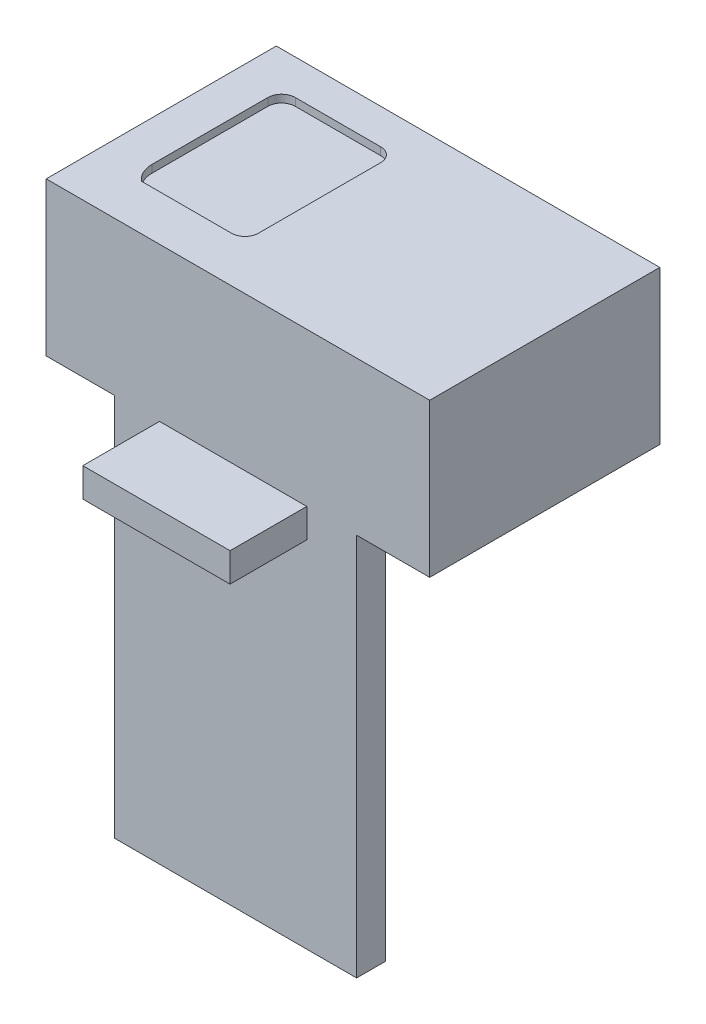
ISO-10303-21;
HEADER;
FILE_DESCRIPTION(('STEP AP214'),'2;1');
FILE_NAME('part.step','',(''),(''),'','','');
FILE_SCHEMA(('AUTOMOTIVE_DESIGN { 1 0 10303 214 1 1 1 1 }'));
ENDSEC;
DATA;
#1=APPLICATION_CONTEXT('core data for automotive mechanical design processes');
#2=APPLICATION_PROTOCOL_DEFINITION('international standard','automotive_design',2000,#1);
#3=PRODUCT_CONTEXT('',#1,'mechanical');
#4=PRODUCT('Part','Part','',(#3));
#5=PRODUCT_RELATED_PRODUCT_CATEGORY('part','',(#4));
#6=PRODUCT_DEFINITION_FORMATION('','',#4);
#7=PRODUCT_DEFINITION_CONTEXT('part definition',#1,'design');
#8=PRODUCT_DEFINITION('design','',#6,#7);
#9=PRODUCT_DEFINITION_SHAPE('','',#8);
#10=(LENGTH_UNIT() NAMED_UNIT(*) SI_UNIT(.MILLI.,.METRE.));
#11=(NAMED_UNIT(*) PLANE_ANGLE_UNIT() SI_UNIT($,.RADIAN.));
#12=(NAMED_UNIT(*) SI_UNIT($,.STERADIAN.) SOLID_ANGLE_UNIT());
#13=UNCERTAINTY_MEASURE_WITH_UNIT(LENGTH_MEASURE(1.E-05),#10,'distance_accuracy_value','');
#14=(GEOMETRIC_REPRESENTATION_CONTEXT(3) GLOBAL_UNCERTAINTY_ASSIGNED_CONTEXT((#13)) GLOBAL_UNIT_ASSIGNED_CONTEXT((#10,
#11,#12)) REPRESENTATION_CONTEXT('',''));
#15=CARTESIAN_POINT('',(0.,0.,0.));
#16=DIRECTION('',(0.,0.,1.));
#17=DIRECTION('',(1.,0.,0.));
#18=AXIS2_PLACEMENT_3D('',#15,#16,#17);
#19=CARTESIAN_POINT('',(-25.,20.,15.));
#20=DIRECTION('',(0.,0.,-1.));
#21=DIRECTION('',(-1.,0.,0.));
#22=AXIS2_PLACEMENT_3D('',#19,#20,#21);
#23=PLANE('',#22);
#24=DIRECTION('',(1.,0.,0.));
#25=VECTOR('',#24,1.);
#26=CARTESIAN_POINT('',(-25.,0.,15.));
#27=LINE('',#26,#25);
#28=CARTESIAN_POINT('',(-25.,0.,15.));
#29=VERTEX_POINT('',#28);
#30=CARTESIAN_POINT('',(-16.0662258898583,0.,15.));
#31=VERTEX_POINT('',#30);
#32=EDGE_CURVE('E291',#29,#31,#27,.T.);
#33=ORIENTED_EDGE('',*,*,#32,.T.);
#34=DIRECTION('',(0.,1.,0.));
#35=VECTOR('',#34,1.);
#36=CARTESIAN_POINT('',(-16.0662258898583,-50.,15.));
#37=LINE('',#36,#35);
#38=CARTESIAN_POINT('',(-16.0662258898583,-50.,15.));
#39=VERTEX_POINT('',#38);
#40=EDGE_CURVE('E220',#39,#31,#37,.T.);
#41=ORIENTED_EDGE('',*,*,#40,.F.);
#42=DIRECTION('',(-1.,0.,0.));
#43=VECTOR('',#42,1.);
#44=CARTESIAN_POINT('',(15.4711251452966,-50.,15.));
#45=LINE('',#44,#43);
#46=CARTESIAN_POINT('',(15.4711251452966,-50.,15.));
#47=VERTEX_POINT('',#46);
#48=EDGE_CURVE('E204',#47,#39,#45,.T.);
#49=ORIENTED_EDGE('',*,*,#48,.F.);
#50=DIRECTION('',(0.,1.,0.));
#51=VECTOR('',#50,1.);
#52=CARTESIAN_POINT('',(15.4711251452966,-50.,15.));
#53=LINE('',#52,#51);
#54=CARTESIAN_POINT('',(15.4711251452966,0.,15.));
#55=VERTEX_POINT('',#54);
#56=EDGE_CURVE('E250',#47,#55,#53,.T.);
#57=ORIENTED_EDGE('',*,*,#56,.T.);
#58=CARTESIAN_POINT('',(25.,0.,15.));
#59=VERTEX_POINT('',#58);
#60=EDGE_CURVE('E304',#55,#59,#27,.T.);
#61=ORIENTED_EDGE('',*,*,#60,.T.);
#62=DIRECTION('',(0.,-1.,0.));
#63=VECTOR('',#62,1.);
#64=CARTESIAN_POINT('',(25.,20.,15.));
#65=LINE('',#64,#63);
#66=CARTESIAN_POINT('',(25.,20.,15.));
#67=VERTEX_POINT('',#66);
#68=EDGE_CURVE('E297',#67,#59,#65,.T.);
#69=ORIENTED_EDGE('',*,*,#68,.F.);
#70=DIRECTION('',(1.,0.,0.));
#71=VECTOR('',#70,1.);
#72=CARTESIAN_POINT('',(-25.,20.,15.));
#73=LINE('',#72,#71);
#74=CARTESIAN_POINT('',(-25.,20.,15.));
#75=VERTEX_POINT('',#74);
#76=EDGE_CURVE('E295',#75,#67,#73,.T.);
#77=ORIENTED_EDGE('',*,*,#76,.F.);
#78=DIRECTION('',(0.,-1.,0.));
#79=VECTOR('',#78,1.);
#80=CARTESIAN_POINT('',(-25.,20.,15.));
#81=LINE('',#80,#79);
#82=EDGE_CURVE('E315',#75,#29,#81,.T.);
#83=ORIENTED_EDGE('',*,*,#82,.T.);
#84=EDGE_LOOP('',(#33,#41,#49,#57,#61,#69,#77,#83));
#85=FACE_BOUND('',#84,.T.);
#86=DIRECTION('',(0.,-1.,0.));
#87=VECTOR('',#86,1.);
#88=CARTESIAN_POINT('',(-10.2277431199127,0.,15.));
#89=LINE('',#88,#87);
#90=CARTESIAN_POINT('',(-10.2277431199127,0.,15.));
#91=VERTEX_POINT('',#90);
#92=CARTESIAN_POINT('',(-10.2277431199127,-3.77838367629124,15.));
#93=VERTEX_POINT('',#92);
#94=EDGE_CURVE('E193',#91,#93,#89,.T.);
#95=ORIENTED_EDGE('',*,*,#94,.F.);
#96=DIRECTION('',(-1.,0.,0.));
#97=VECTOR('',#96,1.);
#98=CARTESIAN_POINT('',(-10.2277431199127,0.,15.));
#99=LINE('',#98,#97);
#100=CARTESIAN_POINT('',(8.97206485990409,0.,15.));
#101=VERTEX_POINT('',#100);
#102=EDGE_CURVE('E190',#101,#91,#99,.T.);
#103=ORIENTED_EDGE('',*,*,#102,.F.);
#104=DIRECTION('',(0.,1.,0.));
#105=VECTOR('',#104,1.);
#106=CARTESIAN_POINT('',(8.97206485990409,0.,15.));
#107=LINE('',#106,#105);
#108=CARTESIAN_POINT('',(8.97206485990409,-3.77838367629124,15.));
#109=VERTEX_POINT('',#108);
#110=EDGE_CURVE('E56',#109,#101,#107,.T.);
#111=ORIENTED_EDGE('',*,*,#110,.F.);
#112=DIRECTION('',(1.,0.,0.));
#113=VECTOR('',#112,1.);
#114=CARTESIAN_POINT('',(-10.2277431199127,-3.77838367629124,15.));
#115=LINE('',#114,#113);
#116=EDGE_CURVE('E51',#93,#109,#115,.T.);
#117=ORIENTED_EDGE('',*,*,#116,.F.);
#118=EDGE_LOOP('',(#95,#103,#111,#117));
#119=FACE_BOUND('',#118,.T.);
#120=ADVANCED_FACE('F33',(#85,#119),#23,.F.);
#121=CARTESIAN_POINT('',(0.,0.,0.));
#122=DIRECTION('',(0.,1.,0.));
#123=DIRECTION('',(0.,0.,1.));
#124=AXIS2_PLACEMENT_3D('',#121,#122,#123);
#125=PLANE('',#124);
#126=DIRECTION('',(0.,0.,1.));
#127=VECTOR('',#126,1.);
#128=CARTESIAN_POINT('',(15.4711251452966,0.,11.2618868974153));
#129=LINE('',#128,#127);
#130=CARTESIAN_POINT('',(15.4711251452966,0.,11.2618868974153));
#131=VERTEX_POINT('',#130);
#132=EDGE_CURVE('E37',#131,#55,#129,.T.);
#133=ORIENTED_EDGE('',*,*,#132,.F.);
#134=DIRECTION('',(1.,0.,0.));
#135=VECTOR('',#134,1.);
#136=CARTESIAN_POINT('',(15.4711251452966,0.,11.2618868974153));
#137=LINE('',#136,#135);
#138=CARTESIAN_POINT('',(-16.0662258898583,0.,11.2618868974153));
#139=VERTEX_POINT('',#138);
#140=EDGE_CURVE('E205',#139,#131,#137,.T.);
#141=ORIENTED_EDGE('',*,*,#140,.F.);
#142=DIRECTION('',(0.,0.,-1.));
#143=VECTOR('',#142,1.);
#144=CARTESIAN_POINT('',(-16.0662258898583,0.,11.2618868974153));
#145=LINE('',#144,#143);
#146=EDGE_CURVE('E196',#31,#139,#145,.T.);
#147=ORIENTED_EDGE('',*,*,#146,.F.);
#148=ORIENTED_EDGE('',*,*,#32,.F.);
#149=DIRECTION('',(0.,0.,1.));
#150=VECTOR('',#149,1.);
#151=CARTESIAN_POINT('',(-25.,0.,-15.));
#152=LINE('',#151,#150);
#153=CARTESIAN_POINT('',(-25.,0.,-15.));
#154=VERTEX_POINT('',#153);
#155=EDGE_CURVE('E302',#154,#29,#152,.T.);
#156=ORIENTED_EDGE('',*,*,#155,.F.);
#157=DIRECTION('',(-1.,0.,0.));
#158=VECTOR('',#157,1.);
#159=CARTESIAN_POINT('',(-25.,0.,-15.));
#160=LINE('',#159,#158);
#161=CARTESIAN_POINT('',(25.,0.,-15.));
#162=VERTEX_POINT('',#161);
#163=EDGE_CURVE('E300',#162,#154,#160,.T.);
#164=ORIENTED_EDGE('',*,*,#163,.F.);
#165=DIRECTION('',(0.,0.,-1.));
#166=VECTOR('',#165,1.);
#167=CARTESIAN_POINT('',(25.,0.,-15.));
#168=LINE('',#167,#166);
#169=EDGE_CURVE('E272',#59,#162,#168,.T.);
#170=ORIENTED_EDGE('',*,*,#169,.F.);
#171=ORIENTED_EDGE('',*,*,#60,.F.);
#172=EDGE_LOOP('',(#133,#141,#147,#148,#156,#164,#170,#171));
#173=FACE_BOUND('',#172,.T.);
#174=ADVANCED_FACE('F328',(#173),#125,.F.);
#175=CARTESIAN_POINT('',(25.,20.,-15.));
#176=DIRECTION('',(-1.,0.,0.));
#177=DIRECTION('',(0.,0.,1.));
#178=AXIS2_PLACEMENT_3D('',#175,#176,#177);
#179=PLANE('',#178);
#180=ORIENTED_EDGE('',*,*,#169,.T.);
#181=DIRECTION('',(0.,-1.,0.));
#182=VECTOR('',#181,1.);
#183=CARTESIAN_POINT('',(25.,20.,-15.));
#184=LINE('',#183,#182);
#185=CARTESIAN_POINT('',(25.,20.,-15.));
#186=VERTEX_POINT('',#185);
#187=EDGE_CURVE('E11',#186,#162,#184,.T.);
#188=ORIENTED_EDGE('',*,*,#187,.F.);
#189=DIRECTION('',(0.,0.,-1.));
#190=VECTOR('',#189,1.);
#191=CARTESIAN_POINT('',(25.,20.,-15.));
#192=LINE('',#191,#190);
#193=EDGE_CURVE('E287',#67,#186,#192,.T.);
#194=ORIENTED_EDGE('',*,*,#193,.F.);
#195=ORIENTED_EDGE('',*,*,#68,.T.);
#196=EDGE_LOOP('',(#180,#188,#194,#195));
#197=FACE_BOUND('',#196,.T.);
#198=ADVANCED_FACE('F35',(#197),#179,.F.);
#199=CARTESIAN_POINT('',(-25.,20.,-15.));
#200=DIRECTION('',(0.,0.,1.));
#201=DIRECTION('',(1.,0.,0.));
#202=AXIS2_PLACEMENT_3D('',#199,#200,#201);
#203=PLANE('',#202);
#204=ORIENTED_EDGE('',*,*,#163,.T.);
#205=DIRECTION('',(0.,-1.,0.));
#206=VECTOR('',#205,1.);
#207=CARTESIAN_POINT('',(-25.,20.,-15.));
#208=LINE('',#207,#206);
#209=CARTESIAN_POINT('',(-25.,20.,-15.));
#210=VERTEX_POINT('',#209);
#211=EDGE_CURVE('E43',#210,#154,#208,.T.);
#212=ORIENTED_EDGE('',*,*,#211,.F.);
#213=DIRECTION('',(-1.,0.,0.));
#214=VECTOR('',#213,1.);
#215=CARTESIAN_POINT('',(-25.,20.,-15.));
#216=LINE('',#215,#214);
#217=EDGE_CURVE('E290',#186,#210,#216,.T.);
#218=ORIENTED_EDGE('',*,*,#217,.F.);
#219=ORIENTED_EDGE('',*,*,#187,.T.);
#220=EDGE_LOOP('',(#204,#212,#218,#219));
#221=FACE_BOUND('',#220,.T.);
#222=ADVANCED_FACE('F333',(#221),#203,.F.);
#223=CARTESIAN_POINT('',(-25.,20.,-15.));
#224=DIRECTION('',(1.,0.,0.));
#225=DIRECTION('',(0.,0.,-1.));
#226=AXIS2_PLACEMENT_3D('',#223,#224,#225);
#227=PLANE('',#226);
#228=ORIENTED_EDGE('',*,*,#155,.T.);
#229=ORIENTED_EDGE('',*,*,#82,.F.);
#230=DIRECTION('',(0.,0.,1.));
#231=VECTOR('',#230,1.);
#232=CARTESIAN_POINT('',(-25.,20.,-15.));
#233=LINE('',#232,#231);
#234=EDGE_CURVE('E293',#210,#75,#233,.T.);
#235=ORIENTED_EDGE('',*,*,#234,.F.);
#236=ORIENTED_EDGE('',*,*,#211,.T.);
#237=EDGE_LOOP('',(#228,#229,#235,#236));
#238=FACE_BOUND('',#237,.T.);
#239=ADVANCED_FACE('F422',(#238),#227,.F.);
#240=CARTESIAN_POINT('',(0.,20.,0.));
#241=DIRECTION('',(0.,1.,0.));
#242=DIRECTION('',(0.,0.,1.));
#243=AXIS2_PLACEMENT_3D('',#240,#241,#242);
#244=PLANE('',#243);
#245=CARTESIAN_POINT('',(-6.81039392346605,20.,-8.63746900239093));
#246=DIRECTION('',(0.,1.,0.));
#247=DIRECTION('',(0.,0.,-1.));
#248=AXIS2_PLACEMENT_3D('',#245,#246,#247);
#249=CIRCLE('',#248,1.78664424229424);
#250=CARTESIAN_POINT('',(-5.02374968117181,20.,-8.63746900239093));
#251=VERTEX_POINT('',#250);
#252=CARTESIAN_POINT('',(-6.81039392346605,20.,-10.4241132446852));
#253=VERTEX_POINT('',#252);
#254=EDGE_CURVE('E247',#251,#253,#249,.T.);
#255=ORIENTED_EDGE('',*,*,#254,.F.);
#256=DIRECTION('',(0.,0.,-1.));
#257=VECTOR('',#256,1.);
#258=CARTESIAN_POINT('',(-5.02374968117181,20.,-8.63746900239093));
#259=LINE('',#258,#257);
#260=CARTESIAN_POINT('',(-5.02374968117181,20.,7.29391113094735));
#261=VERTEX_POINT('',#260);
#262=EDGE_CURVE('E225',#261,#251,#259,.T.);
#263=ORIENTED_EDGE('',*,*,#262,.F.);
#264=CARTESIAN_POINT('',(-6.79099802920291,20.,7.29391113094735));
#265=DIRECTION('',(0.,1.,0.));
#266=DIRECTION('',(0.,0.,-1.));
#267=AXIS2_PLACEMENT_3D('',#264,#265,#266);
#268=CIRCLE('',#267,1.7672483480311);
#269=CARTESIAN_POINT('',(-6.79099802920291,20.,9.06115947897845));
#270=VERTEX_POINT('',#269);
#271=EDGE_CURVE('E265',#270,#261,#268,.T.);
#272=ORIENTED_EDGE('',*,*,#271,.F.);
#273=DIRECTION('',(1.,0.,0.));
#274=VECTOR('',#273,1.);
#275=CARTESIAN_POINT('',(-18.5102239166903,20.,9.06115947897845));
#276=LINE('',#275,#274);
#277=CARTESIAN_POINT('',(-18.5102239166903,20.,9.06115947897845));
#278=VERTEX_POINT('',#277);
#279=EDGE_CURVE('E262',#278,#270,#276,.T.);
#280=ORIENTED_EDGE('',*,*,#279,.F.);
#281=CARTESIAN_POINT('',(-16.3686339960663,20.,6.46060351312983));
#282=DIRECTION('',(0.,1.,0.));
#283=DIRECTION('',(0.,0.,1.));
#284=AXIS2_PLACEMENT_3D('',#281,#282,#283);
#285=CIRCLE('',#284,3.36887202482217);
#286=CARTESIAN_POINT('',(-19.7375060208884,20.,6.46060351312982));
#287=VERTEX_POINT('',#286);
#288=EDGE_CURVE('E259',#287,#278,#285,.T.);
#289=ORIENTED_EDGE('',*,*,#288,.F.);
#290=DIRECTION('',(0.,0.,1.));
#291=VECTOR('',#290,1.);
#292=CARTESIAN_POINT('',(-19.7375060208884,20.,-8.63746900239093));
#293=LINE('',#292,#291);
#294=CARTESIAN_POINT('',(-19.7375060208884,20.,-8.63746900239093));
#295=VERTEX_POINT('',#294);
#296=EDGE_CURVE('E256',#295,#287,#293,.T.);
#297=ORIENTED_EDGE('',*,*,#296,.F.);
#298=CARTESIAN_POINT('',(-17.9508617785942,20.,-8.63746900239093));
#299=DIRECTION('',(0.,1.,0.));
#300=DIRECTION('',(0.,0.,1.));
#301=AXIS2_PLACEMENT_3D('',#298,#299,#300);
#302=CIRCLE('',#301,1.78664424229424);
#303=CARTESIAN_POINT('',(-17.9508617785942,20.,-10.4241132446852));
#304=VERTEX_POINT('',#303);
#305=EDGE_CURVE('E253',#304,#295,#302,.T.);
#306=ORIENTED_EDGE('',*,*,#305,.F.);
#307=DIRECTION('',(-1.,0.,0.));
#308=VECTOR('',#307,1.);
#309=CARTESIAN_POINT('',(-17.9508617785942,20.,-10.4241132446852));
#310=LINE('',#309,#308);
#311=EDGE_CURVE('E249',#253,#304,#310,.T.);
#312=ORIENTED_EDGE('',*,*,#311,.F.);
#313=EDGE_LOOP('',(#255,#263,#272,#280,#289,#297,#306,#312));
#314=FACE_BOUND('',#313,.T.);
#315=ORIENTED_EDGE('',*,*,#193,.T.);
#316=ORIENTED_EDGE('',*,*,#217,.T.);
#317=ORIENTED_EDGE('',*,*,#234,.T.);
#318=ORIENTED_EDGE('',*,*,#76,.T.);
#319=EDGE_LOOP('',(#315,#316,#317,#318));
#320=FACE_BOUND('',#319,.T.);
#321=ADVANCED_FACE('F336',(#314,#320),#244,.T.);
#322=CARTESIAN_POINT('',(-6.81039392346605,19.,-8.63746900239093));
#323=DIRECTION('',(0.,1.,0.));
#324=DIRECTION('',(0.,0.,1.));
#325=AXIS2_PLACEMENT_3D('',#322,#323,#324);
#326=CYLINDRICAL_SURFACE('',#325,1.78664424229424);
#327=ORIENTED_EDGE('',*,*,#254,.T.);
#328=DIRECTION('',(0.,1.,0.));
#329=VECTOR('',#328,1.);
#330=CARTESIAN_POINT('',(-6.81039392346605,19.,-10.4241132446852));
#331=LINE('',#330,#329);
#332=CARTESIAN_POINT('',(-6.81039392346605,19.,-10.4241132446852));
#333=VERTEX_POINT('',#332);
#334=EDGE_CURVE('E246',#333,#253,#331,.T.);
#335=ORIENTED_EDGE('',*,*,#334,.F.);
#336=CARTESIAN_POINT('',(-6.81039392346605,19.,-8.63746900239093));
#337=DIRECTION('',(0.,1.,0.));
#338=DIRECTION('',(0.,0.,-1.));
#339=AXIS2_PLACEMENT_3D('',#336,#337,#338);
#340=CIRCLE('',#339,1.78664424229424);
#341=CARTESIAN_POINT('',(-5.02374968117181,19.,-8.63746900239093));
#342=VERTEX_POINT('',#341);
#343=EDGE_CURVE('E221',#342,#333,#340,.T.);
#344=ORIENTED_EDGE('',*,*,#343,.F.);
#345=DIRECTION('',(0.,1.,0.));
#346=VECTOR('',#345,1.);
#347=CARTESIAN_POINT('',(-5.02374968117181,19.,-8.63746900239093));
#348=LINE('',#347,#346);
#349=EDGE_CURVE('E270',#342,#251,#348,.T.);
#350=ORIENTED_EDGE('',*,*,#349,.T.);
#351=EDGE_LOOP('',(#327,#335,#344,#350));
#352=FACE_BOUND('',#351,.T.);
#353=ADVANCED_FACE('F393',(#352),#326,.F.);
#354=CARTESIAN_POINT('',(-5.02374968117181,19.,-8.63746900239093));
#355=DIRECTION('',(1.,0.,0.));
#356=DIRECTION('',(0.,0.,-1.));
#357=AXIS2_PLACEMENT_3D('',#354,#355,#356);
#358=PLANE('',#357);
#359=ORIENTED_EDGE('',*,*,#262,.T.);
#360=ORIENTED_EDGE('',*,*,#349,.F.);
#361=DIRECTION('',(0.,0.,-1.));
#362=VECTOR('',#361,1.);
#363=CARTESIAN_POINT('',(-5.02374968117181,19.,-8.63746900239093));
#364=LINE('',#363,#362);
#365=CARTESIAN_POINT('',(-5.02374968117181,19.,7.29391113094735));
#366=VERTEX_POINT('',#365);
#367=EDGE_CURVE('E243',#366,#342,#364,.T.);
#368=ORIENTED_EDGE('',*,*,#367,.F.);
#369=DIRECTION('',(0.,1.,0.));
#370=VECTOR('',#369,1.);
#371=CARTESIAN_POINT('',(-5.02374968117181,19.,7.29391113094735));
#372=LINE('',#371,#370);
#373=EDGE_CURVE('E273',#366,#261,#372,.T.);
#374=ORIENTED_EDGE('',*,*,#373,.T.);
#375=EDGE_LOOP('',(#359,#360,#368,#374));
#376=FACE_BOUND('',#375,.T.);
#377=ADVANCED_FACE('F389',(#376),#358,.F.);
#378=CARTESIAN_POINT('',(-6.79099802920291,19.,7.29391113094735));
#379=DIRECTION('',(0.,1.,0.));
#380=DIRECTION('',(0.,0.,1.));
#381=AXIS2_PLACEMENT_3D('',#378,#379,#380);
#382=CYLINDRICAL_SURFACE('',#381,1.7672483480311);
#383=ORIENTED_EDGE('',*,*,#271,.T.);
#384=ORIENTED_EDGE('',*,*,#373,.F.);
#385=CARTESIAN_POINT('',(-6.79099802920291,19.,7.29391113094735));
#386=DIRECTION('',(0.,1.,0.));
#387=DIRECTION('',(0.,0.,-1.));
#388=AXIS2_PLACEMENT_3D('',#385,#386,#387);
#389=CIRCLE('',#388,1.7672483480311);
#390=CARTESIAN_POINT('',(-6.79099802920291,19.,9.06115947897845));
#391=VERTEX_POINT('',#390);
#392=EDGE_CURVE('E240',#391,#366,#389,.T.);
#393=ORIENTED_EDGE('',*,*,#392,.F.);
#394=DIRECTION('',(0.,1.,0.));
#395=VECTOR('',#394,1.);
#396=CARTESIAN_POINT('',(-6.79099802920291,19.,9.06115947897845));
#397=LINE('',#396,#395);
#398=EDGE_CURVE('E275',#391,#270,#397,.T.);
#399=ORIENTED_EDGE('',*,*,#398,.T.);
#400=EDGE_LOOP('',(#383,#384,#393,#399));
#401=FACE_BOUND('',#400,.T.);
#402=ADVANCED_FACE('F392',(#401),#382,.F.);
#403=CARTESIAN_POINT('',(-18.5102239166903,19.,9.06115947897845));
#404=DIRECTION('',(0.,0.,1.));
#405=DIRECTION('',(1.,0.,0.));
#406=AXIS2_PLACEMENT_3D('',#403,#404,#405);
#407=PLANE('',#406);
#408=ORIENTED_EDGE('',*,*,#279,.T.);
#409=ORIENTED_EDGE('',*,*,#398,.F.);
#410=DIRECTION('',(1.,0.,0.));
#411=VECTOR('',#410,1.);
#412=CARTESIAN_POINT('',(-18.5102239166903,19.,9.06115947897845));
#413=LINE('',#412,#411);
#414=CARTESIAN_POINT('',(-18.5102239166903,19.,9.06115947897845));
#415=VERTEX_POINT('',#414);
#416=EDGE_CURVE('E237',#415,#391,#413,.T.);
#417=ORIENTED_EDGE('',*,*,#416,.F.);
#418=DIRECTION('',(0.,1.,0.));
#419=VECTOR('',#418,1.);
#420=CARTESIAN_POINT('',(-18.5102239166903,19.,9.06115947897845));
#421=LINE('',#420,#419);
#422=EDGE_CURVE('E277',#415,#278,#421,.T.);
#423=ORIENTED_EDGE('',*,*,#422,.T.);
#424=EDGE_LOOP('',(#408,#409,#417,#423));
#425=FACE_BOUND('',#424,.T.);
#426=ADVANCED_FACE('F397',(#425),#407,.F.);
#427=CARTESIAN_POINT('',(-16.3686339960663,19.,6.46060351312983));
#428=DIRECTION('',(0.,1.,0.));
#429=DIRECTION('',(0.,0.,1.));
#430=AXIS2_PLACEMENT_3D('',#427,#428,#429);
#431=CYLINDRICAL_SURFACE('',#430,3.36887202482217);
#432=ORIENTED_EDGE('',*,*,#288,.T.);
#433=ORIENTED_EDGE('',*,*,#422,.F.);
#434=CARTESIAN_POINT('',(-16.3686339960663,19.,6.46060351312983));
#435=DIRECTION('',(0.,1.,0.));
#436=DIRECTION('',(0.,0.,1.));
#437=AXIS2_PLACEMENT_3D('',#434,#435,#436);
#438=CIRCLE('',#437,3.36887202482217);
#439=CARTESIAN_POINT('',(-19.7375060208884,19.,6.46060351312982));
#440=VERTEX_POINT('',#439);
#441=EDGE_CURVE('E234',#440,#415,#438,.T.);
#442=ORIENTED_EDGE('',*,*,#441,.F.);
#443=DIRECTION('',(0.,1.,0.));
#444=VECTOR('',#443,1.);
#445=CARTESIAN_POINT('',(-19.7375060208884,19.,6.46060351312982));
#446=LINE('',#445,#444);
#447=EDGE_CURVE('E279',#440,#287,#446,.T.);
#448=ORIENTED_EDGE('',*,*,#447,.T.);
#449=EDGE_LOOP('',(#432,#433,#442,#448));
#450=FACE_BOUND('',#449,.T.);
#451=ADVANCED_FACE('F401',(#450),#431,.F.);
#452=CARTESIAN_POINT('',(-19.7375060208884,19.,-8.63746900239093));
#453=DIRECTION('',(-1.,0.,0.));
#454=DIRECTION('',(0.,0.,1.));
#455=AXIS2_PLACEMENT_3D('',#452,#453,#454);
#456=PLANE('',#455);
#457=ORIENTED_EDGE('',*,*,#296,.T.);
#458=ORIENTED_EDGE('',*,*,#447,.F.);
#459=DIRECTION('',(0.,0.,1.));
#460=VECTOR('',#459,1.);
#461=CARTESIAN_POINT('',(-19.7375060208884,19.,-8.63746900239093));
#462=LINE('',#461,#460);
#463=CARTESIAN_POINT('',(-19.7375060208884,19.,-8.63746900239093));
#464=VERTEX_POINT('',#463);
#465=EDGE_CURVE('E231',#464,#440,#462,.T.);
#466=ORIENTED_EDGE('',*,*,#465,.F.);
#467=DIRECTION('',(0.,1.,0.));
#468=VECTOR('',#467,1.);
#469=CARTESIAN_POINT('',(-19.7375060208884,19.,-8.63746900239093));
#470=LINE('',#469,#468);
#471=EDGE_CURVE('E281',#464,#295,#470,.T.);
#472=ORIENTED_EDGE('',*,*,#471,.T.);
#473=EDGE_LOOP('',(#457,#458,#466,#472));
#474=FACE_BOUND('',#473,.T.);
#475=ADVANCED_FACE('F405',(#474),#456,.F.);
#476=CARTESIAN_POINT('',(-17.9508617785942,19.,-8.63746900239093));
#477=DIRECTION('',(0.,1.,0.));
#478=DIRECTION('',(0.,0.,1.));
#479=AXIS2_PLACEMENT_3D('',#476,#477,#478);
#480=CYLINDRICAL_SURFACE('',#479,1.78664424229424);
#481=ORIENTED_EDGE('',*,*,#305,.T.);
#482=ORIENTED_EDGE('',*,*,#471,.F.);
#483=CARTESIAN_POINT('',(-17.9508617785942,19.,-8.63746900239093));
#484=DIRECTION('',(0.,1.,0.));
#485=DIRECTION('',(0.,0.,1.));
#486=AXIS2_PLACEMENT_3D('',#483,#484,#485);
#487=CIRCLE('',#486,1.78664424229424);
#488=CARTESIAN_POINT('',(-17.9508617785942,19.,-10.4241132446852));
#489=VERTEX_POINT('',#488);
#490=EDGE_CURVE('E228',#489,#464,#487,.T.);
#491=ORIENTED_EDGE('',*,*,#490,.F.);
#492=DIRECTION('',(0.,1.,0.));
#493=VECTOR('',#492,1.);
#494=CARTESIAN_POINT('',(-17.9508617785942,19.,-10.4241132446852));
#495=LINE('',#494,#493);
#496=EDGE_CURVE('E283',#489,#304,#495,.T.);
#497=ORIENTED_EDGE('',*,*,#496,.T.);
#498=EDGE_LOOP('',(#481,#482,#491,#497));
#499=FACE_BOUND('',#498,.T.);
#500=ADVANCED_FACE('F409',(#499),#480,.F.);
#501=CARTESIAN_POINT('',(-17.9508617785942,19.,-10.4241132446852));
#502=DIRECTION('',(0.,0.,-1.));
#503=DIRECTION('',(-1.,0.,0.));
#504=AXIS2_PLACEMENT_3D('',#501,#502,#503);
#505=PLANE('',#504);
#506=ORIENTED_EDGE('',*,*,#311,.T.);
#507=ORIENTED_EDGE('',*,*,#496,.F.);
#508=DIRECTION('',(-1.,0.,0.));
#509=VECTOR('',#508,1.);
#510=CARTESIAN_POINT('',(-17.9508617785942,19.,-10.4241132446852));
#511=LINE('',#510,#509);
#512=EDGE_CURVE('E224',#333,#489,#511,.T.);
#513=ORIENTED_EDGE('',*,*,#512,.F.);
#514=ORIENTED_EDGE('',*,*,#334,.T.);
#515=EDGE_LOOP('',(#506,#507,#513,#514));
#516=FACE_BOUND('',#515,.T.);
#517=ADVANCED_FACE('F387',(#516),#505,.F.);
#518=CARTESIAN_POINT('',(-6.81039392346605,19.,-8.63746900239093));
#519=DIRECTION('',(0.,-1.,0.));
#520=DIRECTION('',(0.,0.,-1.));
#521=AXIS2_PLACEMENT_3D('',#518,#519,#520);
#522=PLANE('',#521);
#523=ORIENTED_EDGE('',*,*,#343,.T.);
#524=ORIENTED_EDGE('',*,*,#512,.T.);
#525=ORIENTED_EDGE('',*,*,#490,.T.);
#526=ORIENTED_EDGE('',*,*,#465,.T.);
#527=ORIENTED_EDGE('',*,*,#441,.T.);
#528=ORIENTED_EDGE('',*,*,#416,.T.);
#529=ORIENTED_EDGE('',*,*,#392,.T.);
#530=ORIENTED_EDGE('',*,*,#367,.T.);
#531=EDGE_LOOP('',(#523,#524,#525,#526,#527,#528,#529,#530));
#532=FACE_BOUND('',#531,.T.);
#533=ADVANCED_FACE('F383',(#532),#522,.F.);
#534=CARTESIAN_POINT('',(15.4711251452966,-50.,11.2618868974153));
#535=DIRECTION('',(-1.,0.,0.));
#536=DIRECTION('',(0.,0.,1.));
#537=AXIS2_PLACEMENT_3D('',#534,#535,#536);
#538=PLANE('',#537);
#539=ORIENTED_EDGE('',*,*,#132,.T.);
#540=ORIENTED_EDGE('',*,*,#56,.F.);
#541=DIRECTION('',(0.,0.,1.));
#542=VECTOR('',#541,1.);
#543=CARTESIAN_POINT('',(15.4711251452966,-50.,11.2618868974153));
#544=LINE('',#543,#542);
#545=CARTESIAN_POINT('',(15.4711251452966,-50.,11.2618868974153));
#546=VERTEX_POINT('',#545);
#547=EDGE_CURVE('E201',#546,#47,#544,.T.);
#548=ORIENTED_EDGE('',*,*,#547,.F.);
#549=DIRECTION('',(0.,1.,0.));
#550=VECTOR('',#549,1.);
#551=CARTESIAN_POINT('',(15.4711251452966,-50.,11.2618868974153));
#552=LINE('',#551,#550);
#553=EDGE_CURVE('E210',#546,#131,#552,.T.);
#554=ORIENTED_EDGE('',*,*,#553,.T.);
#555=EDGE_LOOP('',(#539,#540,#548,#554));
#556=FACE_BOUND('',#555,.T.);
#557=ADVANCED_FACE('F379',(#556),#538,.F.);
#558=CARTESIAN_POINT('',(-16.0662258898583,-50.,11.2618868974153));
#559=DIRECTION('',(1.,0.,0.));
#560=DIRECTION('',(0.,0.,-1.));
#561=AXIS2_PLACEMENT_3D('',#558,#559,#560);
#562=PLANE('',#561);
#563=ORIENTED_EDGE('',*,*,#146,.T.);
#564=DIRECTION('',(0.,1.,0.));
#565=VECTOR('',#564,1.);
#566=CARTESIAN_POINT('',(-16.0662258898583,-50.,11.2618868974153));
#567=LINE('',#566,#565);
#568=CARTESIAN_POINT('',(-16.0662258898583,-50.,11.2618868974153));
#569=VERTEX_POINT('',#568);
#570=EDGE_CURVE('E217',#569,#139,#567,.T.);
#571=ORIENTED_EDGE('',*,*,#570,.F.);
#572=DIRECTION('',(0.,0.,-1.));
#573=VECTOR('',#572,1.);
#574=CARTESIAN_POINT('',(-16.0662258898583,-50.,11.2618868974153));
#575=LINE('',#574,#573);
#576=EDGE_CURVE('E207',#39,#569,#575,.T.);
#577=ORIENTED_EDGE('',*,*,#576,.F.);
#578=ORIENTED_EDGE('',*,*,#40,.T.);
#579=EDGE_LOOP('',(#563,#571,#577,#578));
#580=FACE_BOUND('',#579,.T.);
#581=ADVANCED_FACE('F375',(#580),#562,.F.);
#582=CARTESIAN_POINT('',(15.4711251452966,-50.,11.2618868974153));
#583=DIRECTION('',(0.,0.,1.));
#584=DIRECTION('',(1.,0.,0.));
#585=AXIS2_PLACEMENT_3D('',#582,#583,#584);
#586=PLANE('',#585);
#587=ORIENTED_EDGE('',*,*,#140,.T.);
#588=ORIENTED_EDGE('',*,*,#553,.F.);
#589=DIRECTION('',(1.,0.,0.));
#590=VECTOR('',#589,1.);
#591=CARTESIAN_POINT('',(15.4711251452966,-50.,11.2618868974153));
#592=LINE('',#591,#590);
#593=EDGE_CURVE('E209',#569,#546,#592,.T.);
#594=ORIENTED_EDGE('',*,*,#593,.F.);
#595=ORIENTED_EDGE('',*,*,#570,.T.);
#596=EDGE_LOOP('',(#587,#588,#594,#595));
#597=FACE_BOUND('',#596,.T.);
#598=ADVANCED_FACE('F371',(#597),#586,.F.);
#599=CARTESIAN_POINT('',(0.,-50.,0.));
#600=DIRECTION('',(0.,-1.,0.));
#601=DIRECTION('',(0.,0.,-1.));
#602=AXIS2_PLACEMENT_3D('',#599,#600,#601);
#603=PLANE('',#602);
#604=ORIENTED_EDGE('',*,*,#547,.T.);
#605=ORIENTED_EDGE('',*,*,#48,.T.);
#606=ORIENTED_EDGE('',*,*,#576,.T.);
#607=ORIENTED_EDGE('',*,*,#593,.T.);
#608=EDGE_LOOP('',(#604,#605,#606,#607));
#609=FACE_BOUND('',#608,.T.);
#610=ADVANCED_FACE('F368',(#609),#603,.T.);
#611=CARTESIAN_POINT('',(-10.2277431199127,0.,25.));
#612=DIRECTION('',(1.,0.,0.));
#613=DIRECTION('',(0.,0.,-1.));
#614=AXIS2_PLACEMENT_3D('',#611,#612,#613);
#615=PLANE('',#614);
#616=ORIENTED_EDGE('',*,*,#94,.T.);
#617=DIRECTION('',(0.,0.,-1.));
#618=VECTOR('',#617,1.);
#619=CARTESIAN_POINT('',(-10.2277431199127,-3.77838367629124,25.));
#620=LINE('',#619,#618);
#621=CARTESIAN_POINT('',(-10.2277431199127,-3.77838367629124,25.));
#622=VERTEX_POINT('',#621);
#623=EDGE_CURVE('E174',#622,#93,#620,.T.);
#624=ORIENTED_EDGE('',*,*,#623,.F.);
#625=DIRECTION('',(0.,-1.,0.));
#626=VECTOR('',#625,1.);
#627=CARTESIAN_POINT('',(-10.2277431199127,0.,25.));
#628=LINE('',#627,#626);
#629=CARTESIAN_POINT('',(-10.2277431199127,0.,25.));
#630=VERTEX_POINT('',#629);
#631=EDGE_CURVE('E181',#630,#622,#628,.T.);
#632=ORIENTED_EDGE('',*,*,#631,.F.);
#633=DIRECTION('',(0.,0.,-1.));
#634=VECTOR('',#633,1.);
#635=CARTESIAN_POINT('',(-10.2277431199127,0.,25.));
#636=LINE('',#635,#634);
#637=EDGE_CURVE('E346',#630,#91,#636,.T.);
#638=ORIENTED_EDGE('',*,*,#637,.T.);
#639=EDGE_LOOP('',(#616,#624,#632,#638));
#640=FACE_BOUND('',#639,.T.);
#641=ADVANCED_FACE('F192',(#640),#615,.F.);
#642=CARTESIAN_POINT('',(-10.2277431199127,-3.77838367629124,25.));
#643=DIRECTION('',(0.,1.,0.));
#644=DIRECTION('',(0.,0.,1.));
#645=AXIS2_PLACEMENT_3D('',#642,#643,#644);
#646=PLANE('',#645);
#647=ORIENTED_EDGE('',*,*,#116,.T.);
#648=DIRECTION('',(0.,0.,-1.));
#649=VECTOR('',#648,1.);
#650=CARTESIAN_POINT('',(8.97206485990409,-3.77838367629124,25.));
#651=LINE('',#650,#649);
#652=CARTESIAN_POINT('',(8.97206485990409,-3.77838367629124,25.));
#653=VERTEX_POINT('',#652);
#654=EDGE_CURVE('E177',#653,#109,#651,.T.);
#655=ORIENTED_EDGE('',*,*,#654,.F.);
#656=DIRECTION('',(1.,0.,0.));
#657=VECTOR('',#656,1.);
#658=CARTESIAN_POINT('',(-10.2277431199127,-3.77838367629124,25.));
#659=LINE('',#658,#657);
#660=EDGE_CURVE('E170',#622,#653,#659,.T.);
#661=ORIENTED_EDGE('',*,*,#660,.F.);
#662=ORIENTED_EDGE('',*,*,#623,.T.);
#663=EDGE_LOOP('',(#647,#655,#661,#662));
#664=FACE_BOUND('',#663,.T.);
#665=ADVANCED_FACE('F172',(#664),#646,.F.);
#666=CARTESIAN_POINT('',(8.97206485990409,0.,25.));
#667=DIRECTION('',(-1.,0.,0.));
#668=DIRECTION('',(0.,0.,1.));
#669=AXIS2_PLACEMENT_3D('',#666,#667,#668);
#670=PLANE('',#669);
#671=ORIENTED_EDGE('',*,*,#110,.T.);
#672=DIRECTION('',(0.,0.,-1.));
#673=VECTOR('',#672,1.);
#674=CARTESIAN_POINT('',(8.97206485990409,0.,25.));
#675=LINE('',#674,#673);
#676=CARTESIAN_POINT('',(8.97206485990409,0.,25.));
#677=VERTEX_POINT('',#676);
#678=EDGE_CURVE('E197',#677,#101,#675,.T.);
#679=ORIENTED_EDGE('',*,*,#678,.F.);
#680=DIRECTION('',(0.,1.,0.));
#681=VECTOR('',#680,1.);
#682=CARTESIAN_POINT('',(8.97206485990409,0.,25.));
#683=LINE('',#682,#681);
#684=EDGE_CURVE('E180',#653,#677,#683,.T.);
#685=ORIENTED_EDGE('',*,*,#684,.F.);
#686=ORIENTED_EDGE('',*,*,#654,.T.);
#687=EDGE_LOOP('',(#671,#679,#685,#686));
#688=FACE_BOUND('',#687,.T.);
#689=ADVANCED_FACE('F355',(#688),#670,.F.);
#690=CARTESIAN_POINT('',(-10.2277431199127,0.,25.));
#691=DIRECTION('',(0.,-1.,0.));
#692=DIRECTION('',(0.,0.,-1.));
#693=AXIS2_PLACEMENT_3D('',#690,#691,#692);
#694=PLANE('',#693);
#695=ORIENTED_EDGE('',*,*,#102,.T.);
#696=ORIENTED_EDGE('',*,*,#637,.F.);
#697=DIRECTION('',(-1.,0.,0.));
#698=VECTOR('',#697,1.);
#699=CARTESIAN_POINT('',(-10.2277431199127,0.,25.));
#700=LINE('',#699,#698);
#701=EDGE_CURVE('E186',#677,#630,#700,.T.);
#702=ORIENTED_EDGE('',*,*,#701,.F.);
#703=ORIENTED_EDGE('',*,*,#678,.T.);
#704=EDGE_LOOP('',(#695,#696,#702,#703));
#705=FACE_BOUND('',#704,.T.);
#706=ADVANCED_FACE('F345',(#705),#694,.F.);
#707=CARTESIAN_POINT('',(0.,0.,25.));
#708=DIRECTION('',(0.,0.,1.));
#709=DIRECTION('',(1.,0.,0.));
#710=AXIS2_PLACEMENT_3D('',#707,#708,#709);
#711=PLANE('',#710);
#712=ORIENTED_EDGE('',*,*,#631,.T.);
#713=ORIENTED_EDGE('',*,*,#660,.T.);
#714=ORIENTED_EDGE('',*,*,#684,.T.);
#715=ORIENTED_EDGE('',*,*,#701,.T.);
#716=EDGE_LOOP('',(#712,#713,#714,#715));
#717=FACE_BOUND('',#716,.T.);
#718=ADVANCED_FACE('F184',(#717),#711,.T.);
#719=CLOSED_SHELL('',(#120,#174,#198,#222,#239,#321,#353,#377,#402,#426,#451,#475,#500,#517,
#533,#557,#581,#598,#610,#641,#665,#689,#706,#718));
#720=MANIFOLD_SOLID_BREP('B2',#719);
#721=ADVANCED_BREP_SHAPE_REPRESENTATION('',(#18,#720),#14);
#722=SHAPE_DEFINITION_REPRESENTATION(#9,#721);
ENDSEC;
END-ISO-10303-21;
